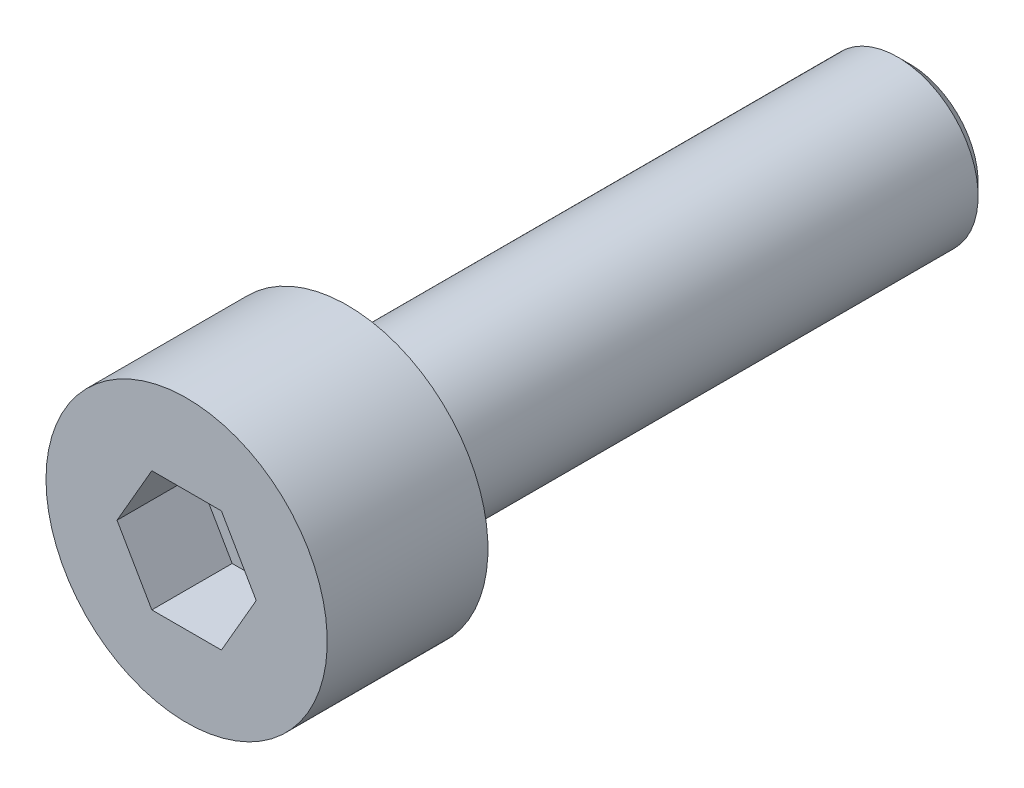
ISO-10303-21;
HEADER;
FILE_DESCRIPTION(('STEP AP214'),'2;1');
FILE_NAME('part.step','',(''),(''),'','','');
FILE_SCHEMA(('AUTOMOTIVE_DESIGN { 1 0 10303 214 1 1 1 1 }'));
ENDSEC;
DATA;
#1=APPLICATION_CONTEXT('core data for automotive mechanical design processes');
#2=APPLICATION_PROTOCOL_DEFINITION('international standard','automotive_design',2000,#1);
#3=PRODUCT_CONTEXT('',#1,'mechanical');
#4=PRODUCT('Part','Part','',(#3));
#5=PRODUCT_RELATED_PRODUCT_CATEGORY('part','',(#4));
#6=PRODUCT_DEFINITION_FORMATION('','',#4);
#7=PRODUCT_DEFINITION_CONTEXT('part definition',#1,'design');
#8=PRODUCT_DEFINITION('design','',#6,#7);
#9=PRODUCT_DEFINITION_SHAPE('','',#8);
#10=(LENGTH_UNIT() NAMED_UNIT(*) SI_UNIT(.MILLI.,.METRE.));
#11=(NAMED_UNIT(*) PLANE_ANGLE_UNIT() SI_UNIT($,.RADIAN.));
#12=(NAMED_UNIT(*) SI_UNIT($,.STERADIAN.) SOLID_ANGLE_UNIT());
#13=UNCERTAINTY_MEASURE_WITH_UNIT(LENGTH_MEASURE(1.E-05),#10,'distance_accuracy_value','');
#14=(GEOMETRIC_REPRESENTATION_CONTEXT(3) GLOBAL_UNCERTAINTY_ASSIGNED_CONTEXT((#13)) GLOBAL_UNIT_ASSIGNED_CONTEXT((#10,
#11,#12)) REPRESENTATION_CONTEXT('',''));
#15=CARTESIAN_POINT('',(0.,0.,0.));
#16=DIRECTION('',(0.,0.,1.));
#17=DIRECTION('',(1.,0.,0.));
#18=AXIS2_PLACEMENT_3D('',#15,#16,#17);
#19=CARTESIAN_POINT('',(0.,0.,0.));
#20=DIRECTION('',(0.,0.,1.));
#21=DIRECTION('',(1.,0.,0.));
#22=AXIS2_PLACEMENT_3D('',#19,#20,#21);
#23=PLANE('',#22);
#24=DIRECTION('',(0.5,0.866025403784439,0.));
#25=VECTOR('',#24,1.);
#26=CARTESIAN_POINT('',(0.86602540378444,-1.5,0.));
#27=LINE('',#26,#25);
#28=CARTESIAN_POINT('',(0.86602540378444,-1.5,0.));
#29=VERTEX_POINT('',#28);
#30=CARTESIAN_POINT('',(1.73205080756888,0.,0.));
#31=VERTEX_POINT('',#30);
#32=EDGE_CURVE('E49',#29,#31,#27,.T.);
#33=ORIENTED_EDGE('',*,*,#32,.F.);
#34=DIRECTION('',(1.,0.,0.));
#35=VECTOR('',#34,1.);
#36=CARTESIAN_POINT('',(-0.866025403784438,-1.5,0.));
#37=LINE('',#36,#35);
#38=CARTESIAN_POINT('',(-0.866025403784438,-1.5,0.));
#39=VERTEX_POINT('',#38);
#40=EDGE_CURVE('E132',#39,#29,#37,.T.);
#41=ORIENTED_EDGE('',*,*,#40,.F.);
#42=DIRECTION('',(0.5,-0.866025403784438,0.));
#43=VECTOR('',#42,1.);
#44=CARTESIAN_POINT('',(-1.73205080756888,0.,0.));
#45=LINE('',#44,#43);
#46=CARTESIAN_POINT('',(-1.73205080756888,0.,0.));
#47=VERTEX_POINT('',#46);
#48=EDGE_CURVE('E130',#47,#39,#45,.T.);
#49=ORIENTED_EDGE('',*,*,#48,.F.);
#50=DIRECTION('',(-0.5,-0.866025403784439,0.));
#51=VECTOR('',#50,1.);
#52=CARTESIAN_POINT('',(-0.866025403784438,1.5,0.));
#53=LINE('',#52,#51);
#54=CARTESIAN_POINT('',(-0.866025403784438,1.5,0.));
#55=VERTEX_POINT('',#54);
#56=EDGE_CURVE('E97',#55,#47,#53,.T.);
#57=ORIENTED_EDGE('',*,*,#56,.F.);
#58=DIRECTION('',(-1.,0.,0.));
#59=VECTOR('',#58,1.);
#60=CARTESIAN_POINT('',(0.866025403784438,1.5,0.));
#61=LINE('',#60,#59);
#62=CARTESIAN_POINT('',(0.866025403784438,1.5,0.));
#63=VERTEX_POINT('',#62);
#64=EDGE_CURVE('E126',#63,#55,#61,.T.);
#65=ORIENTED_EDGE('',*,*,#64,.F.);
#66=DIRECTION('',(-0.5,0.866025403784438,0.));
#67=VECTOR('',#66,1.);
#68=CARTESIAN_POINT('',(1.73205080756888,0.,0.));
#69=LINE('',#68,#67);
#70=EDGE_CURVE('E123',#31,#63,#69,.T.);
#71=ORIENTED_EDGE('',*,*,#70,.F.);
#72=EDGE_LOOP('',(#33,#41,#49,#57,#65,#71));
#73=FACE_BOUND('',#72,.T.);
#74=CARTESIAN_POINT('',(0.,0.,0.));
#75=DIRECTION('',(0.,0.,-1.));
#76=DIRECTION('',(-1.,0.,0.));
#77=AXIS2_PLACEMENT_3D('',#74,#75,#76);
#78=CIRCLE('',#77,3.5);
#79=CARTESIAN_POINT('',(-3.5,0.,0.));
#80=VERTEX_POINT('',#79);
#81=EDGE_CURVE('E144',#80,#80,#78,.T.);
#82=ORIENTED_EDGE('',*,*,#81,.F.);
#83=EDGE_LOOP('',(#82));
#84=FACE_BOUND('',#83,.T.);
#85=ADVANCED_FACE('F34',(#73,#84),#23,.T.);
#86=CARTESIAN_POINT('',(0.,0.,0.));
#87=DIRECTION('',(0.,0.,-1.));
#88=DIRECTION('',(-1.,0.,0.));
#89=AXIS2_PLACEMENT_3D('',#86,#87,#88);
#90=CYLINDRICAL_SURFACE('',#89,3.5);
#91=ORIENTED_EDGE('',*,*,#81,.T.);
#92=EDGE_LOOP('',(#91));
#93=FACE_BOUND('',#92,.T.);
#94=CARTESIAN_POINT('',(0.,0.,-4.));
#95=DIRECTION('',(0.,0.,-1.));
#96=DIRECTION('',(-1.,0.,0.));
#97=AXIS2_PLACEMENT_3D('',#94,#95,#96);
#98=CIRCLE('',#97,3.5);
#99=CARTESIAN_POINT('',(-3.5,0.,-4.));
#100=VERTEX_POINT('',#99);
#101=EDGE_CURVE('E136',#100,#100,#98,.T.);
#102=ORIENTED_EDGE('',*,*,#101,.F.);
#103=EDGE_LOOP('',(#102));
#104=FACE_BOUND('',#103,.T.);
#105=ADVANCED_FACE('F166',(#93,#104),#90,.T.);
#106=CARTESIAN_POINT('',(0.,3.5,-4.));
#107=DIRECTION('',(0.,0.,-1.));
#108=DIRECTION('',(-1.,0.,0.));
#109=AXIS2_PLACEMENT_3D('',#106,#107,#108);
#110=PLANE('',#109);
#111=CARTESIAN_POINT('',(0.,0.,-4.));
#112=DIRECTION('',(0.,0.,-1.));
#113=DIRECTION('',(-1.,0.,0.));
#114=AXIS2_PLACEMENT_3D('',#111,#112,#113);
#115=CIRCLE('',#114,2.3);
#116=CARTESIAN_POINT('',(-2.3,0.,-4.));
#117=VERTEX_POINT('',#116);
#118=EDGE_CURVE('E150',#117,#117,#115,.F.);
#119=ORIENTED_EDGE('',*,*,#118,.T.);
#120=EDGE_LOOP('',(#119));
#121=FACE_BOUND('',#120,.T.);
#122=ORIENTED_EDGE('',*,*,#101,.T.);
#123=EDGE_LOOP('',(#122));
#124=FACE_BOUND('',#123,.T.);
#125=ADVANCED_FACE('F172',(#121,#124),#110,.T.);
#126=CARTESIAN_POINT('',(0.,0.,0.));
#127=DIRECTION('',(0.,0.,-1.));
#128=DIRECTION('',(-1.,0.,0.));
#129=AXIS2_PLACEMENT_3D('',#126,#127,#128);
#130=CYLINDRICAL_SURFACE('',#129,2.);
#131=CARTESIAN_POINT('',(0.,0.,-17.7));
#132=DIRECTION('',(0.,0.,-1.));
#133=DIRECTION('',(-1.,0.,0.));
#134=AXIS2_PLACEMENT_3D('',#131,#132,#133);
#135=CIRCLE('',#134,2.);
#136=CARTESIAN_POINT('',(-2.,0.,-17.7));
#137=VERTEX_POINT('',#136);
#138=EDGE_CURVE('E11',#137,#137,#135,.F.);
#139=ORIENTED_EDGE('',*,*,#138,.T.);
#140=EDGE_LOOP('',(#139));
#141=FACE_BOUND('',#140,.T.);
#142=CARTESIAN_POINT('',(0.,0.,-4.3));
#143=DIRECTION('',(0.,0.,-1.));
#144=DIRECTION('',(-1.,0.,0.));
#145=AXIS2_PLACEMENT_3D('',#142,#143,#144);
#146=CIRCLE('',#145,2.);
#147=CARTESIAN_POINT('',(-2.,0.,-4.3));
#148=VERTEX_POINT('',#147);
#149=EDGE_CURVE('E147',#148,#148,#146,.T.);
#150=ORIENTED_EDGE('',*,*,#149,.T.);
#151=EDGE_LOOP('',(#150));
#152=FACE_BOUND('',#151,.T.);
#153=ADVANCED_FACE('F179',(#141,#152),#130,.T.);
#154=CARTESIAN_POINT('',(0.,2.,-18.));
#155=DIRECTION('',(0.,0.,-1.));
#156=DIRECTION('',(-1.,0.,0.));
#157=AXIS2_PLACEMENT_3D('',#154,#155,#156);
#158=PLANE('',#157);
#159=CARTESIAN_POINT('',(0.,0.,-18.));
#160=DIRECTION('',(0.,0.,-1.));
#161=DIRECTION('',(-1.,0.,0.));
#162=AXIS2_PLACEMENT_3D('',#159,#160,#161);
#163=CIRCLE('',#162,1.69999999999999);
#164=CARTESIAN_POINT('',(-1.69999999999999,0.,-18.));
#165=VERTEX_POINT('',#164);
#166=EDGE_CURVE('E42',#165,#165,#163,.T.);
#167=ORIENTED_EDGE('',*,*,#166,.T.);
#168=EDGE_LOOP('',(#167));
#169=FACE_BOUND('',#168,.T.);
#170=ADVANCED_FACE('F155',(#169),#158,.T.);
#171=CARTESIAN_POINT('',(0.86602540378444,-1.5,-2.));
#172=DIRECTION('',(0.866025403784439,-0.5,0.));
#173=DIRECTION('',(0.5,0.866025403784439,0.));
#174=AXIS2_PLACEMENT_3D('',#171,#172,#173);
#175=PLANE('',#174);
#176=ORIENTED_EDGE('',*,*,#32,.T.);
#177=DIRECTION('',(0.,0.,1.));
#178=VECTOR('',#177,1.);
#179=CARTESIAN_POINT('',(1.73205080756888,0.,-2.));
#180=LINE('',#179,#178);
#181=CARTESIAN_POINT('',(1.73205080756888,0.,-2.));
#182=VERTEX_POINT('',#181);
#183=EDGE_CURVE('E79',#182,#31,#180,.T.);
#184=ORIENTED_EDGE('',*,*,#183,.F.);
#185=DIRECTION('',(0.5,0.866025403784439,0.));
#186=VECTOR('',#185,1.);
#187=CARTESIAN_POINT('',(0.86602540378444,-1.5,-2.));
#188=LINE('',#187,#186);
#189=CARTESIAN_POINT('',(0.86602540378444,-1.5,-2.));
#190=VERTEX_POINT('',#189);
#191=EDGE_CURVE('E134',#190,#182,#188,.T.);
#192=ORIENTED_EDGE('',*,*,#191,.F.);
#193=DIRECTION('',(0.,0.,1.));
#194=VECTOR('',#193,1.);
#195=CARTESIAN_POINT('',(0.86602540378444,-1.5,-2.));
#196=LINE('',#195,#194);
#197=EDGE_CURVE('E57',#190,#29,#196,.T.);
#198=ORIENTED_EDGE('',*,*,#197,.T.);
#199=EDGE_LOOP('',(#176,#184,#192,#198));
#200=FACE_BOUND('',#199,.T.);
#201=ADVANCED_FACE('F186',(#200),#175,.F.);
#202=CARTESIAN_POINT('',(-0.866025403784438,-1.5,-2.));
#203=DIRECTION('',(0.,-1.,0.));
#204=DIRECTION('',(1.,0.,0.));
#205=AXIS2_PLACEMENT_3D('',#202,#203,#204);
#206=PLANE('',#205);
#207=ORIENTED_EDGE('',*,*,#40,.T.);
#208=ORIENTED_EDGE('',*,*,#197,.F.);
#209=DIRECTION('',(1.,0.,0.));
#210=VECTOR('',#209,1.);
#211=CARTESIAN_POINT('',(-0.866025403784438,-1.5,-2.));
#212=LINE('',#211,#210);
#213=CARTESIAN_POINT('',(-0.866025403784438,-1.5,-2.));
#214=VERTEX_POINT('',#213);
#215=EDGE_CURVE('E109',#214,#190,#212,.T.);
#216=ORIENTED_EDGE('',*,*,#215,.F.);
#217=DIRECTION('',(0.,0.,1.));
#218=VECTOR('',#217,1.);
#219=CARTESIAN_POINT('',(-0.866025403784438,-1.5,-2.));
#220=LINE('',#219,#218);
#221=EDGE_CURVE('E101',#214,#39,#220,.T.);
#222=ORIENTED_EDGE('',*,*,#221,.T.);
#223=EDGE_LOOP('',(#207,#208,#216,#222));
#224=FACE_BOUND('',#223,.T.);
#225=ADVANCED_FACE('F189',(#224),#206,.F.);
#226=CARTESIAN_POINT('',(-1.73205080756888,0.,-2.));
#227=DIRECTION('',(-0.866025403784438,-0.5,0.));
#228=DIRECTION('',(0.5,-0.866025403784438,0.));
#229=AXIS2_PLACEMENT_3D('',#226,#227,#228);
#230=PLANE('',#229);
#231=ORIENTED_EDGE('',*,*,#48,.T.);
#232=ORIENTED_EDGE('',*,*,#221,.F.);
#233=DIRECTION('',(0.5,-0.866025403784438,0.));
#234=VECTOR('',#233,1.);
#235=CARTESIAN_POINT('',(-1.73205080756888,0.,-2.));
#236=LINE('',#235,#234);
#237=CARTESIAN_POINT('',(-1.73205080756888,0.,-2.));
#238=VERTEX_POINT('',#237);
#239=EDGE_CURVE('E105',#238,#214,#236,.T.);
#240=ORIENTED_EDGE('',*,*,#239,.F.);
#241=DIRECTION('',(0.,0.,1.));
#242=VECTOR('',#241,1.);
#243=CARTESIAN_POINT('',(-1.73205080756888,0.,-2.));
#244=LINE('',#243,#242);
#245=EDGE_CURVE('E90',#238,#47,#244,.T.);
#246=ORIENTED_EDGE('',*,*,#245,.T.);
#247=EDGE_LOOP('',(#231,#232,#240,#246));
#248=FACE_BOUND('',#247,.T.);
#249=ADVANCED_FACE('F106',(#248),#230,.F.);
#250=CARTESIAN_POINT('',(-0.866025403784438,1.5,-2.));
#251=DIRECTION('',(-0.866025403784439,0.5,0.));
#252=DIRECTION('',(-0.5,-0.866025403784439,0.));
#253=AXIS2_PLACEMENT_3D('',#250,#251,#252);
#254=PLANE('',#253);
#255=ORIENTED_EDGE('',*,*,#56,.T.);
#256=ORIENTED_EDGE('',*,*,#245,.F.);
#257=DIRECTION('',(-0.5,-0.866025403784439,0.));
#258=VECTOR('',#257,1.);
#259=CARTESIAN_POINT('',(-0.866025403784438,1.5,-2.));
#260=LINE('',#259,#258);
#261=CARTESIAN_POINT('',(-0.866025403784438,1.5,-2.));
#262=VERTEX_POINT('',#261);
#263=EDGE_CURVE('E94',#262,#238,#260,.T.);
#264=ORIENTED_EDGE('',*,*,#263,.F.);
#265=DIRECTION('',(0.,0.,1.));
#266=VECTOR('',#265,1.);
#267=CARTESIAN_POINT('',(-0.866025403784438,1.5,-2.));
#268=LINE('',#267,#266);
#269=EDGE_CURVE('E102',#262,#55,#268,.T.);
#270=ORIENTED_EDGE('',*,*,#269,.T.);
#271=EDGE_LOOP('',(#255,#256,#264,#270));
#272=FACE_BOUND('',#271,.T.);
#273=ADVANCED_FACE('F92',(#272),#254,.F.);
#274=CARTESIAN_POINT('',(0.866025403784438,1.5,-2.));
#275=DIRECTION('',(0.,1.,0.));
#276=DIRECTION('',(0.,0.,1.));
#277=AXIS2_PLACEMENT_3D('',#274,#275,#276);
#278=PLANE('',#277);
#279=ORIENTED_EDGE('',*,*,#64,.T.);
#280=ORIENTED_EDGE('',*,*,#269,.F.);
#281=DIRECTION('',(-1.,0.,0.));
#282=VECTOR('',#281,1.);
#283=CARTESIAN_POINT('',(0.866025403784438,1.5,-2.));
#284=LINE('',#283,#282);
#285=CARTESIAN_POINT('',(0.866025403784438,1.5,-2.));
#286=VERTEX_POINT('',#285);
#287=EDGE_CURVE('E115',#286,#262,#284,.T.);
#288=ORIENTED_EDGE('',*,*,#287,.F.);
#289=DIRECTION('',(0.,0.,1.));
#290=VECTOR('',#289,1.);
#291=CARTESIAN_POINT('',(0.866025403784438,1.5,-2.));
#292=LINE('',#291,#290);
#293=EDGE_CURVE('E139',#286,#63,#292,.T.);
#294=ORIENTED_EDGE('',*,*,#293,.T.);
#295=EDGE_LOOP('',(#279,#280,#288,#294));
#296=FACE_BOUND('',#295,.T.);
#297=ADVANCED_FACE('F193',(#296),#278,.F.);
#298=CARTESIAN_POINT('',(1.73205080756888,0.,-2.));
#299=DIRECTION('',(0.866025403784438,0.5,0.));
#300=DIRECTION('',(-0.5,0.866025403784438,0.));
#301=AXIS2_PLACEMENT_3D('',#298,#299,#300);
#302=PLANE('',#301);
#303=ORIENTED_EDGE('',*,*,#70,.T.);
#304=ORIENTED_EDGE('',*,*,#293,.F.);
#305=DIRECTION('',(-0.5,0.866025403784438,0.));
#306=VECTOR('',#305,1.);
#307=CARTESIAN_POINT('',(1.73205080756888,0.,-2.));
#308=LINE('',#307,#306);
#309=EDGE_CURVE('E117',#182,#286,#308,.T.);
#310=ORIENTED_EDGE('',*,*,#309,.F.);
#311=ORIENTED_EDGE('',*,*,#183,.T.);
#312=EDGE_LOOP('',(#303,#304,#310,#311));
#313=FACE_BOUND('',#312,.T.);
#314=ADVANCED_FACE('F190',(#313),#302,.F.);
#315=CARTESIAN_POINT('',(0.,0.,-2.));
#316=DIRECTION('',(0.,0.,1.));
#317=DIRECTION('',(1.,0.,0.));
#318=AXIS2_PLACEMENT_3D('',#315,#316,#317);
#319=PLANE('',#318);
#320=ORIENTED_EDGE('',*,*,#191,.T.);
#321=ORIENTED_EDGE('',*,*,#309,.T.);
#322=ORIENTED_EDGE('',*,*,#287,.T.);
#323=ORIENTED_EDGE('',*,*,#263,.T.);
#324=ORIENTED_EDGE('',*,*,#239,.T.);
#325=ORIENTED_EDGE('',*,*,#215,.T.);
#326=EDGE_LOOP('',(#320,#321,#322,#323,#324,#325));
#327=FACE_BOUND('',#326,.T.);
#328=ADVANCED_FACE('F112',(#327),#319,.T.);
#329=CARTESIAN_POINT('',(0.,0.,-4.3));
#330=DIRECTION('',(0.,0.,-1.));
#331=DIRECTION('',(-1.,0.,0.));
#332=AXIS2_PLACEMENT_3D('',#329,#330,#331);
#333=TOROIDAL_SURFACE('',#332,2.3,0.3);
#334=ORIENTED_EDGE('',*,*,#118,.F.);
#335=EDGE_LOOP('',(#334));
#336=FACE_BOUND('',#335,.T.);
#337=ORIENTED_EDGE('',*,*,#149,.F.);
#338=EDGE_LOOP('',(#337));
#339=FACE_BOUND('',#338,.T.);
#340=ADVANCED_FACE('F158',(#336,#339),#333,.F.);
#341=CARTESIAN_POINT('',(0.,0.,-18.));
#342=DIRECTION('',(0.,0.,1.));
#343=DIRECTION('',(1.,0.,0.));
#344=AXIS2_PLACEMENT_3D('',#341,#342,#343);
#345=CONICAL_SURFACE('',#344,1.69999999999999,0.785398163397449);
#346=ORIENTED_EDGE('',*,*,#138,.F.);
#347=EDGE_LOOP('',(#346));
#348=FACE_BOUND('',#347,.T.);
#349=ORIENTED_EDGE('',*,*,#166,.F.);
#350=EDGE_LOOP('',(#349));
#351=FACE_BOUND('',#350,.T.);
#352=ADVANCED_FACE('F36',(#348,#351),#345,.T.);
#353=CLOSED_SHELL('',(#85,#105,#125,#153,#170,#201,#225,#249,#273,#297,#314,#328,#340,#352));
#354=MANIFOLD_SOLID_BREP('B2',#353);
#355=ADVANCED_BREP_SHAPE_REPRESENTATION('',(#18,#354),#14);
#356=SHAPE_DEFINITION_REPRESENTATION(#9,#355);
ENDSEC;
END-ISO-10303-21;
